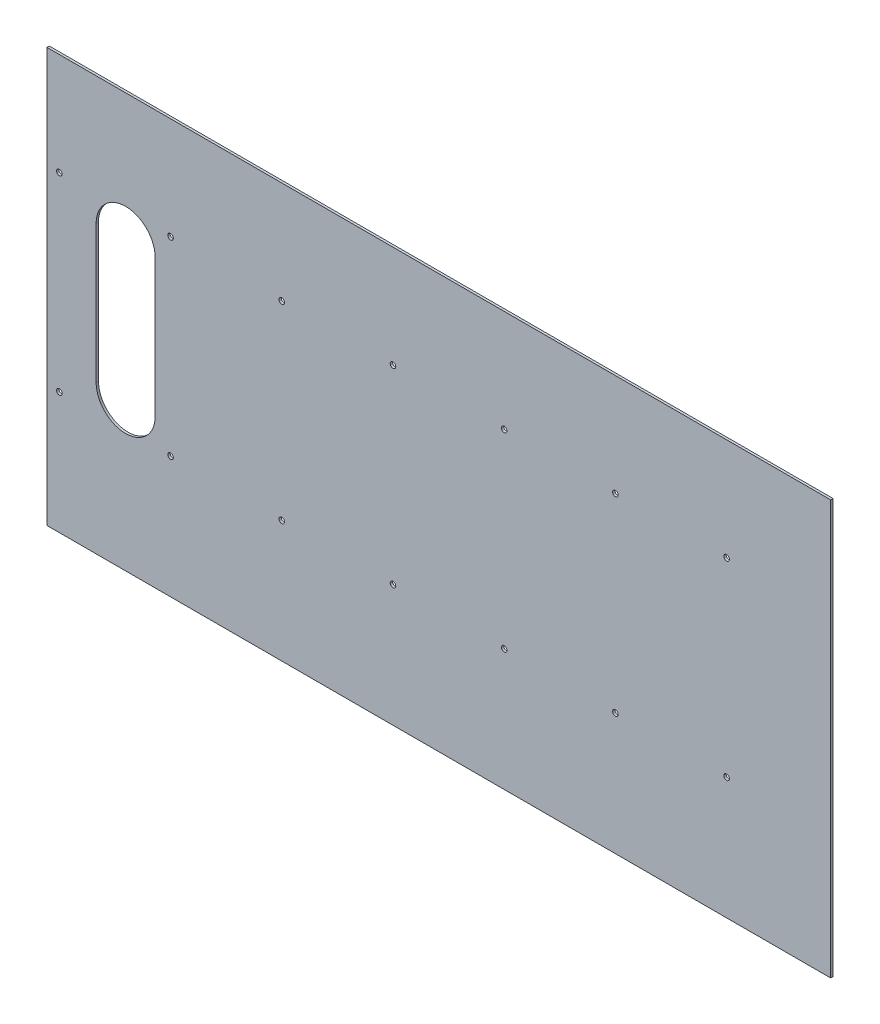
ISO-10303-21;
HEADER;
FILE_DESCRIPTION(('STEP AP214'),'2;1');
FILE_NAME('part.step','',(''),(''),'','','');
FILE_SCHEMA(('AUTOMOTIVE_DESIGN { 1 0 10303 214 1 1 1 1 }'));
ENDSEC;
DATA;
#1=APPLICATION_CONTEXT('core data for automotive mechanical design processes');
#2=APPLICATION_PROTOCOL_DEFINITION('international standard','automotive_design',2000,#1);
#3=PRODUCT_CONTEXT('',#1,'mechanical');
#4=PRODUCT('Part','Part','',(#3));
#5=PRODUCT_RELATED_PRODUCT_CATEGORY('part','',(#4));
#6=PRODUCT_DEFINITION_FORMATION('','',#4);
#7=PRODUCT_DEFINITION_CONTEXT('part definition',#1,'design');
#8=PRODUCT_DEFINITION('design','',#6,#7);
#9=PRODUCT_DEFINITION_SHAPE('','',#8);
#10=(LENGTH_UNIT() NAMED_UNIT(*) SI_UNIT(.MILLI.,.METRE.));
#11=(NAMED_UNIT(*) PLANE_ANGLE_UNIT() SI_UNIT($,.RADIAN.));
#12=(NAMED_UNIT(*) SI_UNIT($,.STERADIAN.) SOLID_ANGLE_UNIT());
#13=UNCERTAINTY_MEASURE_WITH_UNIT(LENGTH_MEASURE(1.E-05),#10,'distance_accuracy_value','');
#14=(GEOMETRIC_REPRESENTATION_CONTEXT(3) GLOBAL_UNCERTAINTY_ASSIGNED_CONTEXT((#13)) GLOBAL_UNIT_ASSIGNED_CONTEXT((#10,
#11,#12)) REPRESENTATION_CONTEXT('',''));
#15=CARTESIAN_POINT('',(0.,0.,0.));
#16=DIRECTION('',(0.,0.,1.));
#17=DIRECTION('',(1.,0.,0.));
#18=AXIS2_PLACEMENT_3D('',#15,#16,#17);
#19=CARTESIAN_POINT('',(-425.1425,-65.01892,1.51892));
#20=DIRECTION('',(1.,0.,0.));
#21=DIRECTION('',(0.,0.,-1.));
#22=AXIS2_PLACEMENT_3D('',#19,#20,#21);
#23=PLANE('',#22);
#24=DIRECTION('',(0.,-1.,0.));
#25=VECTOR('',#24,1.);
#26=CARTESIAN_POINT('',(-425.1425,-65.01892,0.));
#27=LINE('',#26,#25);
#28=CARTESIAN_POINT('',(-425.1425,202.31892,0.));
#29=VERTEX_POINT('',#28);
#30=CARTESIAN_POINT('',(-425.1425,-65.01892,0.));
#31=VERTEX_POINT('',#30);
#32=EDGE_CURVE('E139',#29,#31,#27,.T.);
#33=ORIENTED_EDGE('',*,*,#32,.T.);
#34=DIRECTION('',(0.,0.,-1.));
#35=VECTOR('',#34,1.);
#36=CARTESIAN_POINT('',(-425.1425,-65.01892,1.51892));
#37=LINE('',#36,#35);
#38=CARTESIAN_POINT('',(-425.1425,-65.01892,1.51892));
#39=VERTEX_POINT('',#38);
#40=EDGE_CURVE('E11',#39,#31,#37,.T.);
#41=ORIENTED_EDGE('',*,*,#40,.F.);
#42=DIRECTION('',(0.,-1.,0.));
#43=VECTOR('',#42,1.);
#44=CARTESIAN_POINT('',(-425.1425,-65.01892,1.51892));
#45=LINE('',#44,#43);
#46=CARTESIAN_POINT('',(-425.1425,202.31892,1.51892));
#47=VERTEX_POINT('',#46);
#48=EDGE_CURVE('E143',#47,#39,#45,.T.);
#49=ORIENTED_EDGE('',*,*,#48,.F.);
#50=DIRECTION('',(0.,0.,-1.));
#51=VECTOR('',#50,1.);
#52=CARTESIAN_POINT('',(-425.1425,202.31892,1.51892));
#53=LINE('',#52,#51);
#54=EDGE_CURVE('E153',#47,#29,#53,.T.);
#55=ORIENTED_EDGE('',*,*,#54,.T.);
#56=EDGE_LOOP('',(#33,#41,#49,#55));
#57=FACE_BOUND('',#56,.T.);
#58=ADVANCED_FACE('F38',(#57),#23,.F.);
#59=CARTESIAN_POINT('',(-425.1425,-65.01892,1.51892));
#60=DIRECTION('',(0.,1.,0.));
#61=DIRECTION('',(0.,0.,1.));
#62=AXIS2_PLACEMENT_3D('',#59,#60,#61);
#63=PLANE('',#62);
#64=DIRECTION('',(1.,0.,0.));
#65=VECTOR('',#64,1.);
#66=CARTESIAN_POINT('',(-425.1425,-65.01892,0.));
#67=LINE('',#66,#65);
#68=CARTESIAN_POINT('',(80.8574999999996,-65.01892,0.));
#69=VERTEX_POINT('',#68);
#70=EDGE_CURVE('E156',#31,#69,#67,.T.);
#71=ORIENTED_EDGE('',*,*,#70,.T.);
#72=DIRECTION('',(0.,0.,-1.));
#73=VECTOR('',#72,1.);
#74=CARTESIAN_POINT('',(80.8574999999996,-65.01892,1.51892));
#75=LINE('',#74,#73);
#76=CARTESIAN_POINT('',(80.8574999999996,-65.01892,1.51892));
#77=VERTEX_POINT('',#76);
#78=EDGE_CURVE('E46',#77,#69,#75,.T.);
#79=ORIENTED_EDGE('',*,*,#78,.F.);
#80=DIRECTION('',(1.,0.,0.));
#81=VECTOR('',#80,1.);
#82=CARTESIAN_POINT('',(-425.1425,-65.01892,1.51892));
#83=LINE('',#82,#81);
#84=EDGE_CURVE('E146',#39,#77,#83,.T.);
#85=ORIENTED_EDGE('',*,*,#84,.F.);
#86=ORIENTED_EDGE('',*,*,#40,.T.);
#87=EDGE_LOOP('',(#71,#79,#85,#86));
#88=FACE_BOUND('',#87,.T.);
#89=ADVANCED_FACE('F185',(#88),#63,.F.);
#90=CARTESIAN_POINT('',(80.8574999999996,-65.01892,1.51892));
#91=DIRECTION('',(-1.,0.,0.));
#92=DIRECTION('',(0.,0.,1.));
#93=AXIS2_PLACEMENT_3D('',#90,#91,#92);
#94=PLANE('',#93);
#95=DIRECTION('',(0.,1.,0.));
#96=VECTOR('',#95,1.);
#97=CARTESIAN_POINT('',(80.8574999999996,-65.01892,0.));
#98=LINE('',#97,#96);
#99=CARTESIAN_POINT('',(80.8574999999996,202.31892,0.));
#100=VERTEX_POINT('',#99);
#101=EDGE_CURVE('E158',#69,#100,#98,.T.);
#102=ORIENTED_EDGE('',*,*,#101,.T.);
#103=DIRECTION('',(0.,0.,-1.));
#104=VECTOR('',#103,1.);
#105=CARTESIAN_POINT('',(80.8574999999996,202.31892,1.51892));
#106=LINE('',#105,#104);
#107=CARTESIAN_POINT('',(80.8574999999996,202.31892,1.51892));
#108=VERTEX_POINT('',#107);
#109=EDGE_CURVE('E163',#108,#100,#106,.T.);
#110=ORIENTED_EDGE('',*,*,#109,.F.);
#111=DIRECTION('',(0.,1.,0.));
#112=VECTOR('',#111,1.);
#113=CARTESIAN_POINT('',(80.8574999999996,-65.01892,1.51892));
#114=LINE('',#113,#112);
#115=EDGE_CURVE('E149',#77,#108,#114,.T.);
#116=ORIENTED_EDGE('',*,*,#115,.F.);
#117=ORIENTED_EDGE('',*,*,#78,.T.);
#118=EDGE_LOOP('',(#102,#110,#116,#117));
#119=FACE_BOUND('',#118,.T.);
#120=ADVANCED_FACE('F171',(#119),#94,.F.);
#121=CARTESIAN_POINT('',(-425.1425,202.31892,1.51892));
#122=DIRECTION('',(0.,-1.,0.));
#123=DIRECTION('',(0.,0.,-1.));
#124=AXIS2_PLACEMENT_3D('',#121,#122,#123);
#125=PLANE('',#124);
#126=DIRECTION('',(-1.,0.,0.));
#127=VECTOR('',#126,1.);
#128=CARTESIAN_POINT('',(-425.1425,202.31892,0.));
#129=LINE('',#128,#127);
#130=EDGE_CURVE('E147',#100,#29,#129,.T.);
#131=ORIENTED_EDGE('',*,*,#130,.T.);
#132=ORIENTED_EDGE('',*,*,#54,.F.);
#133=DIRECTION('',(-1.,0.,0.));
#134=VECTOR('',#133,1.);
#135=CARTESIAN_POINT('',(-425.1425,202.31892,1.51892));
#136=LINE('',#135,#134);
#137=EDGE_CURVE('E151',#108,#47,#136,.T.);
#138=ORIENTED_EDGE('',*,*,#137,.F.);
#139=ORIENTED_EDGE('',*,*,#109,.T.);
#140=EDGE_LOOP('',(#131,#132,#138,#139));
#141=FACE_BOUND('',#140,.T.);
#142=ADVANCED_FACE('F178',(#141),#125,.F.);
#143=CARTESIAN_POINT('',(0.,0.,1.51892));
#144=DIRECTION('',(0.,0.,-1.));
#145=DIRECTION('',(-1.,0.,0.));
#146=AXIS2_PLACEMENT_3D('',#143,#144,#145);
#147=PLANE('',#146);
#148=CARTESIAN_POINT('',(-417.1425,136.3375,1.51892));
#149=DIRECTION('',(0.,0.,1.));
#150=DIRECTION('',(1.,0.,0.));
#151=AXIS2_PLACEMENT_3D('',#148,#149,#150);
#152=CIRCLE('',#151,1.79999999999997);
#153=CARTESIAN_POINT('',(-415.3425,136.3375,1.51892));
#154=VERTEX_POINT('',#153);
#155=EDGE_CURVE('E275',#154,#154,#152,.T.);
#156=ORIENTED_EDGE('',*,*,#155,.F.);
#157=EDGE_LOOP('',(#156));
#158=FACE_BOUND('',#157,.T.);
#159=CARTESIAN_POINT('',(-417.1425,13.6624999999999,1.51892));
#160=DIRECTION('',(0.,0.,1.));
#161=DIRECTION('',(1.,0.,0.));
#162=AXIS2_PLACEMENT_3D('',#159,#160,#161);
#163=CIRCLE('',#162,1.79999999999997);
#164=CARTESIAN_POINT('',(-415.3425,13.6624999999999,1.51892));
#165=VERTEX_POINT('',#164);
#166=EDGE_CURVE('E277',#165,#165,#163,.T.);
#167=ORIENTED_EDGE('',*,*,#166,.F.);
#168=EDGE_LOOP('',(#167));
#169=FACE_BOUND('',#168,.T.);
#170=CARTESIAN_POINT('',(-345.341667,136.3375,1.51892));
#171=DIRECTION('',(0.,0.,1.));
#172=DIRECTION('',(1.,0.,0.));
#173=AXIS2_PLACEMENT_3D('',#170,#171,#172);
#174=CIRCLE('',#173,1.79999999999997);
#175=CARTESIAN_POINT('',(-343.541667,136.3375,1.51892));
#176=VERTEX_POINT('',#175);
#177=EDGE_CURVE('E285',#176,#176,#174,.T.);
#178=ORIENTED_EDGE('',*,*,#177,.F.);
#179=EDGE_LOOP('',(#178));
#180=FACE_BOUND('',#179,.T.);
#181=CARTESIAN_POINT('',(-345.341667,13.6624999999999,1.51892));
#182=DIRECTION('',(0.,0.,1.));
#183=DIRECTION('',(1.,0.,0.));
#184=AXIS2_PLACEMENT_3D('',#181,#182,#183);
#185=CIRCLE('',#184,1.79999999999997);
#186=CARTESIAN_POINT('',(-343.541667,13.6624999999999,1.51892));
#187=VERTEX_POINT('',#186);
#188=EDGE_CURVE('E291',#187,#187,#185,.T.);
#189=ORIENTED_EDGE('',*,*,#188,.F.);
#190=EDGE_LOOP('',(#189));
#191=FACE_BOUND('',#190,.T.);
#192=CARTESIAN_POINT('',(-273.540834,136.3375,1.51892));
#193=DIRECTION('',(0.,0.,1.));
#194=DIRECTION('',(1.,0.,0.));
#195=AXIS2_PLACEMENT_3D('',#192,#193,#194);
#196=CIRCLE('',#195,1.79999999999997);
#197=CARTESIAN_POINT('',(-271.740834,136.3375,1.51892));
#198=VERTEX_POINT('',#197);
#199=EDGE_CURVE('E297',#198,#198,#196,.T.);
#200=ORIENTED_EDGE('',*,*,#199,.F.);
#201=EDGE_LOOP('',(#200));
#202=FACE_BOUND('',#201,.T.);
#203=CARTESIAN_POINT('',(-273.540834,13.6624999999999,1.51892));
#204=DIRECTION('',(0.,0.,1.));
#205=DIRECTION('',(1.,0.,0.));
#206=AXIS2_PLACEMENT_3D('',#203,#204,#205);
#207=CIRCLE('',#206,1.79999999999997);
#208=CARTESIAN_POINT('',(-271.740834,13.6624999999999,1.51892));
#209=VERTEX_POINT('',#208);
#210=EDGE_CURVE('E303',#209,#209,#207,.T.);
#211=ORIENTED_EDGE('',*,*,#210,.F.);
#212=EDGE_LOOP('',(#211));
#213=FACE_BOUND('',#212,.T.);
#214=CARTESIAN_POINT('',(-201.740001,136.3375,1.51892));
#215=DIRECTION('',(0.,0.,1.));
#216=DIRECTION('',(1.,0.,0.));
#217=AXIS2_PLACEMENT_3D('',#214,#215,#216);
#218=CIRCLE('',#217,1.8);
#219=CARTESIAN_POINT('',(-199.940001,136.3375,1.51892));
#220=VERTEX_POINT('',#219);
#221=EDGE_CURVE('E309',#220,#220,#218,.T.);
#222=ORIENTED_EDGE('',*,*,#221,.F.);
#223=EDGE_LOOP('',(#222));
#224=FACE_BOUND('',#223,.T.);
#225=CARTESIAN_POINT('',(-201.740001,13.6624999999999,1.51892));
#226=DIRECTION('',(0.,0.,1.));
#227=DIRECTION('',(1.,0.,0.));
#228=AXIS2_PLACEMENT_3D('',#225,#226,#227);
#229=CIRCLE('',#228,1.8);
#230=CARTESIAN_POINT('',(-199.940001,13.6624999999999,1.51892));
#231=VERTEX_POINT('',#230);
#232=EDGE_CURVE('E315',#231,#231,#229,.T.);
#233=ORIENTED_EDGE('',*,*,#232,.F.);
#234=EDGE_LOOP('',(#233));
#235=FACE_BOUND('',#234,.T.);
#236=CARTESIAN_POINT('',(-129.939168,136.3375,1.51892));
#237=DIRECTION('',(0.,0.,1.));
#238=DIRECTION('',(1.,0.,0.));
#239=AXIS2_PLACEMENT_3D('',#236,#237,#238);
#240=CIRCLE('',#239,1.8);
#241=CARTESIAN_POINT('',(-128.139168,136.3375,1.51892));
#242=VERTEX_POINT('',#241);
#243=EDGE_CURVE('E321',#242,#242,#240,.T.);
#244=ORIENTED_EDGE('',*,*,#243,.F.);
#245=EDGE_LOOP('',(#244));
#246=FACE_BOUND('',#245,.T.);
#247=CARTESIAN_POINT('',(-129.939168,13.6624999999999,1.51892));
#248=DIRECTION('',(0.,0.,1.));
#249=DIRECTION('',(1.,0.,0.));
#250=AXIS2_PLACEMENT_3D('',#247,#248,#249);
#251=CIRCLE('',#250,1.8);
#252=CARTESIAN_POINT('',(-128.139168,13.6624999999999,1.51892));
#253=VERTEX_POINT('',#252);
#254=EDGE_CURVE('E327',#253,#253,#251,.T.);
#255=ORIENTED_EDGE('',*,*,#254,.F.);
#256=EDGE_LOOP('',(#255));
#257=FACE_BOUND('',#256,.T.);
#258=CARTESIAN_POINT('',(-58.1383350000004,136.3375,1.51892));
#259=DIRECTION('',(0.,0.,1.));
#260=DIRECTION('',(1.,0.,0.));
#261=AXIS2_PLACEMENT_3D('',#258,#259,#260);
#262=CIRCLE('',#261,1.79999999999999);
#263=CARTESIAN_POINT('',(-56.3383350000004,136.3375,1.51892));
#264=VERTEX_POINT('',#263);
#265=EDGE_CURVE('E333',#264,#264,#262,.T.);
#266=ORIENTED_EDGE('',*,*,#265,.F.);
#267=EDGE_LOOP('',(#266));
#268=FACE_BOUND('',#267,.T.);
#269=CARTESIAN_POINT('',(-58.1383350000004,13.6624999999999,1.51892));
#270=DIRECTION('',(0.,0.,1.));
#271=DIRECTION('',(1.,0.,0.));
#272=AXIS2_PLACEMENT_3D('',#269,#270,#271);
#273=CIRCLE('',#272,1.79999999999999);
#274=CARTESIAN_POINT('',(-56.3383350000004,13.6624999999999,1.51892));
#275=VERTEX_POINT('',#274);
#276=EDGE_CURVE('E339',#275,#275,#273,.T.);
#277=ORIENTED_EDGE('',*,*,#276,.F.);
#278=EDGE_LOOP('',(#277));
#279=FACE_BOUND('',#278,.T.);
#280=CARTESIAN_POINT('',(13.6624979999996,136.3375,1.51892));
#281=DIRECTION('',(0.,0.,1.));
#282=DIRECTION('',(1.,0.,0.));
#283=AXIS2_PLACEMENT_3D('',#280,#281,#282);
#284=CIRCLE('',#283,1.79999999999999);
#285=CARTESIAN_POINT('',(15.4624979999996,136.3375,1.51892));
#286=VERTEX_POINT('',#285);
#287=EDGE_CURVE('E342',#286,#286,#284,.T.);
#288=ORIENTED_EDGE('',*,*,#287,.F.);
#289=EDGE_LOOP('',(#288));
#290=FACE_BOUND('',#289,.T.);
#291=CARTESIAN_POINT('',(13.6624979999996,13.6624999999999,1.51892));
#292=DIRECTION('',(0.,0.,1.));
#293=DIRECTION('',(1.,0.,0.));
#294=AXIS2_PLACEMENT_3D('',#291,#292,#293);
#295=CIRCLE('',#294,1.79999999999999);
#296=CARTESIAN_POINT('',(15.4624979999996,13.6624999999999,1.51892));
#297=VERTEX_POINT('',#296);
#298=EDGE_CURVE('E347',#297,#297,#295,.T.);
#299=ORIENTED_EDGE('',*,*,#298,.F.);
#300=EDGE_LOOP('',(#299));
#301=FACE_BOUND('',#300,.T.);
#302=DIRECTION('',(0.,1.,0.));
#303=VECTOR('',#302,1.);
#304=CARTESIAN_POINT('',(-355.2925,30.86892,1.51892));
#305=LINE('',#304,#303);
#306=CARTESIAN_POINT('',(-355.2925,30.86892,1.51892));
#307=VERTEX_POINT('',#306);
#308=CARTESIAN_POINT('',(-355.2925,119.76892,1.51892));
#309=VERTEX_POINT('',#308);
#310=EDGE_CURVE('E133',#307,#309,#305,.T.);
#311=ORIENTED_EDGE('',*,*,#310,.F.);
#312=CARTESIAN_POINT('',(-374.3425,30.86892,1.51892));
#313=DIRECTION('',(0.,0.,1.));
#314=DIRECTION('',(1.,0.,0.));
#315=AXIS2_PLACEMENT_3D('',#312,#313,#314);
#316=CIRCLE('',#315,19.05);
#317=CARTESIAN_POINT('',(-393.3925,30.86892,1.51892));
#318=VERTEX_POINT('',#317);
#319=EDGE_CURVE('E53',#318,#307,#316,.T.);
#320=ORIENTED_EDGE('',*,*,#319,.F.);
#321=DIRECTION('',(0.,-1.,0.));
#322=VECTOR('',#321,1.);
#323=CARTESIAN_POINT('',(-393.3925,30.86892,1.51892));
#324=LINE('',#323,#322);
#325=CARTESIAN_POINT('',(-393.3925,119.76892,1.51892));
#326=VERTEX_POINT('',#325);
#327=EDGE_CURVE('E121',#326,#318,#324,.T.);
#328=ORIENTED_EDGE('',*,*,#327,.F.);
#329=CARTESIAN_POINT('',(-374.3425,119.76892,1.51892));
#330=DIRECTION('',(0.,0.,1.));
#331=DIRECTION('',(1.,0.,0.));
#332=AXIS2_PLACEMENT_3D('',#329,#330,#331);
#333=CIRCLE('',#332,19.0500000000001);
#334=EDGE_CURVE('E124',#309,#326,#333,.T.);
#335=ORIENTED_EDGE('',*,*,#334,.F.);
#336=EDGE_LOOP('',(#311,#320,#328,#335));
#337=FACE_BOUND('',#336,.T.);
#338=ORIENTED_EDGE('',*,*,#48,.T.);
#339=ORIENTED_EDGE('',*,*,#84,.T.);
#340=ORIENTED_EDGE('',*,*,#115,.T.);
#341=ORIENTED_EDGE('',*,*,#137,.T.);
#342=EDGE_LOOP('',(#338,#339,#340,#341));
#343=FACE_BOUND('',#342,.T.);
#344=ADVANCED_FACE('F184',(#158,#169,#180,#191,#202,#213,#224,#235,#246,#257,#268,#279,#290,
#301,#337,#343),#147,.F.);
#345=CARTESIAN_POINT('',(0.,0.,0.));
#346=DIRECTION('',(0.,0.,-1.));
#347=DIRECTION('',(-1.,0.,0.));
#348=AXIS2_PLACEMENT_3D('',#345,#346,#347);
#349=PLANE('',#348);
#350=CARTESIAN_POINT('',(-417.1425,136.3375,0.));
#351=DIRECTION('',(0.,0.,-1.));
#352=DIRECTION('',(-1.,0.,0.));
#353=AXIS2_PLACEMENT_3D('',#350,#351,#352);
#354=CIRCLE('',#353,1.79999999999997);
#355=CARTESIAN_POINT('',(-418.9425,136.3375,0.));
#356=VERTEX_POINT('',#355);
#357=EDGE_CURVE('E272',#356,#356,#354,.T.);
#358=ORIENTED_EDGE('',*,*,#357,.F.);
#359=EDGE_LOOP('',(#358));
#360=FACE_BOUND('',#359,.T.);
#361=CARTESIAN_POINT('',(-417.1425,13.6624999999999,0.));
#362=DIRECTION('',(0.,0.,-1.));
#363=DIRECTION('',(-1.,0.,0.));
#364=AXIS2_PLACEMENT_3D('',#361,#362,#363);
#365=CIRCLE('',#364,1.79999999999997);
#366=CARTESIAN_POINT('',(-418.9425,13.6624999999999,0.));
#367=VERTEX_POINT('',#366);
#368=EDGE_CURVE('E282',#367,#367,#365,.T.);
#369=ORIENTED_EDGE('',*,*,#368,.F.);
#370=EDGE_LOOP('',(#369));
#371=FACE_BOUND('',#370,.T.);
#372=CARTESIAN_POINT('',(-345.341667,136.3375,0.));
#373=DIRECTION('',(0.,0.,-1.));
#374=DIRECTION('',(-1.,0.,0.));
#375=AXIS2_PLACEMENT_3D('',#372,#373,#374);
#376=CIRCLE('',#375,1.79999999999997);
#377=CARTESIAN_POINT('',(-347.141667,136.3375,0.));
#378=VERTEX_POINT('',#377);
#379=EDGE_CURVE('E288',#378,#378,#376,.T.);
#380=ORIENTED_EDGE('',*,*,#379,.F.);
#381=EDGE_LOOP('',(#380));
#382=FACE_BOUND('',#381,.T.);
#383=CARTESIAN_POINT('',(-345.341667,13.6624999999999,0.));
#384=DIRECTION('',(0.,0.,-1.));
#385=DIRECTION('',(-1.,0.,0.));
#386=AXIS2_PLACEMENT_3D('',#383,#384,#385);
#387=CIRCLE('',#386,1.79999999999997);
#388=CARTESIAN_POINT('',(-347.141667,13.6624999999999,0.));
#389=VERTEX_POINT('',#388);
#390=EDGE_CURVE('E294',#389,#389,#387,.T.);
#391=ORIENTED_EDGE('',*,*,#390,.F.);
#392=EDGE_LOOP('',(#391));
#393=FACE_BOUND('',#392,.T.);
#394=CARTESIAN_POINT('',(-273.540834,136.3375,0.));
#395=DIRECTION('',(0.,0.,-1.));
#396=DIRECTION('',(-1.,0.,0.));
#397=AXIS2_PLACEMENT_3D('',#394,#395,#396);
#398=CIRCLE('',#397,1.79999999999997);
#399=CARTESIAN_POINT('',(-275.340834,136.3375,0.));
#400=VERTEX_POINT('',#399);
#401=EDGE_CURVE('E300',#400,#400,#398,.T.);
#402=ORIENTED_EDGE('',*,*,#401,.F.);
#403=EDGE_LOOP('',(#402));
#404=FACE_BOUND('',#403,.T.);
#405=CARTESIAN_POINT('',(-273.540834,13.6624999999999,0.));
#406=DIRECTION('',(0.,0.,-1.));
#407=DIRECTION('',(-1.,0.,0.));
#408=AXIS2_PLACEMENT_3D('',#405,#406,#407);
#409=CIRCLE('',#408,1.79999999999997);
#410=CARTESIAN_POINT('',(-275.340834,13.6624999999999,0.));
#411=VERTEX_POINT('',#410);
#412=EDGE_CURVE('E306',#411,#411,#409,.T.);
#413=ORIENTED_EDGE('',*,*,#412,.F.);
#414=EDGE_LOOP('',(#413));
#415=FACE_BOUND('',#414,.T.);
#416=CARTESIAN_POINT('',(-201.740001,136.3375,0.));
#417=DIRECTION('',(0.,0.,-1.));
#418=DIRECTION('',(-1.,0.,0.));
#419=AXIS2_PLACEMENT_3D('',#416,#417,#418);
#420=CIRCLE('',#419,1.8);
#421=CARTESIAN_POINT('',(-203.540001,136.3375,0.));
#422=VERTEX_POINT('',#421);
#423=EDGE_CURVE('E312',#422,#422,#420,.T.);
#424=ORIENTED_EDGE('',*,*,#423,.F.);
#425=EDGE_LOOP('',(#424));
#426=FACE_BOUND('',#425,.T.);
#427=CARTESIAN_POINT('',(-201.740001,13.6624999999999,0.));
#428=DIRECTION('',(0.,0.,-1.));
#429=DIRECTION('',(-1.,0.,0.));
#430=AXIS2_PLACEMENT_3D('',#427,#428,#429);
#431=CIRCLE('',#430,1.8);
#432=CARTESIAN_POINT('',(-203.540001,13.6624999999999,0.));
#433=VERTEX_POINT('',#432);
#434=EDGE_CURVE('E318',#433,#433,#431,.T.);
#435=ORIENTED_EDGE('',*,*,#434,.F.);
#436=EDGE_LOOP('',(#435));
#437=FACE_BOUND('',#436,.T.);
#438=CARTESIAN_POINT('',(-129.939168,136.3375,0.));
#439=DIRECTION('',(0.,0.,-1.));
#440=DIRECTION('',(-1.,0.,0.));
#441=AXIS2_PLACEMENT_3D('',#438,#439,#440);
#442=CIRCLE('',#441,1.8);
#443=CARTESIAN_POINT('',(-131.739168,136.3375,0.));
#444=VERTEX_POINT('',#443);
#445=EDGE_CURVE('E324',#444,#444,#442,.T.);
#446=ORIENTED_EDGE('',*,*,#445,.F.);
#447=EDGE_LOOP('',(#446));
#448=FACE_BOUND('',#447,.T.);
#449=CARTESIAN_POINT('',(-129.939168,13.6624999999999,0.));
#450=DIRECTION('',(0.,0.,-1.));
#451=DIRECTION('',(-1.,0.,0.));
#452=AXIS2_PLACEMENT_3D('',#449,#450,#451);
#453=CIRCLE('',#452,1.8);
#454=CARTESIAN_POINT('',(-131.739168,13.6624999999999,0.));
#455=VERTEX_POINT('',#454);
#456=EDGE_CURVE('E330',#455,#455,#453,.T.);
#457=ORIENTED_EDGE('',*,*,#456,.F.);
#458=EDGE_LOOP('',(#457));
#459=FACE_BOUND('',#458,.T.);
#460=CARTESIAN_POINT('',(-58.1383350000004,136.3375,0.));
#461=DIRECTION('',(0.,0.,-1.));
#462=DIRECTION('',(-1.,0.,0.));
#463=AXIS2_PLACEMENT_3D('',#460,#461,#462);
#464=CIRCLE('',#463,1.79999999999999);
#465=CARTESIAN_POINT('',(-59.9383350000004,136.3375,0.));
#466=VERTEX_POINT('',#465);
#467=EDGE_CURVE('E336',#466,#466,#464,.T.);
#468=ORIENTED_EDGE('',*,*,#467,.F.);
#469=EDGE_LOOP('',(#468));
#470=FACE_BOUND('',#469,.T.);
#471=CARTESIAN_POINT('',(-58.1383350000004,13.6624999999999,0.));
#472=DIRECTION('',(0.,0.,-1.));
#473=DIRECTION('',(-1.,0.,0.));
#474=AXIS2_PLACEMENT_3D('',#471,#472,#473);
#475=CIRCLE('',#474,1.79999999999999);
#476=CARTESIAN_POINT('',(-59.9383350000004,13.6624999999999,0.));
#477=VERTEX_POINT('',#476);
#478=EDGE_CURVE('E41',#477,#477,#475,.T.);
#479=ORIENTED_EDGE('',*,*,#478,.F.);
#480=EDGE_LOOP('',(#479));
#481=FACE_BOUND('',#480,.T.);
#482=CARTESIAN_POINT('',(13.6624979999996,136.3375,0.));
#483=DIRECTION('',(0.,0.,-1.));
#484=DIRECTION('',(-1.,0.,0.));
#485=AXIS2_PLACEMENT_3D('',#482,#483,#484);
#486=CIRCLE('',#485,1.79999999999999);
#487=CARTESIAN_POINT('',(11.8624979999996,136.3375,0.));
#488=VERTEX_POINT('',#487);
#489=EDGE_CURVE('E345',#488,#488,#486,.T.);
#490=ORIENTED_EDGE('',*,*,#489,.F.);
#491=EDGE_LOOP('',(#490));
#492=FACE_BOUND('',#491,.T.);
#493=CARTESIAN_POINT('',(13.6624979999996,13.6624999999999,0.));
#494=DIRECTION('',(0.,0.,-1.));
#495=DIRECTION('',(-1.,0.,0.));
#496=AXIS2_PLACEMENT_3D('',#493,#494,#495);
#497=CIRCLE('',#496,1.79999999999999);
#498=CARTESIAN_POINT('',(11.8624979999996,13.6624999999999,0.));
#499=VERTEX_POINT('',#498);
#500=EDGE_CURVE('E127',#499,#499,#497,.T.);
#501=ORIENTED_EDGE('',*,*,#500,.F.);
#502=EDGE_LOOP('',(#501));
#503=FACE_BOUND('',#502,.T.);
#504=CARTESIAN_POINT('',(-374.3425,30.86892,0.));
#505=DIRECTION('',(0.,0.,1.));
#506=DIRECTION('',(1.,0.,0.));
#507=AXIS2_PLACEMENT_3D('',#504,#505,#506);
#508=CIRCLE('',#507,19.05);
#509=CARTESIAN_POINT('',(-393.3925,30.86892,0.));
#510=VERTEX_POINT('',#509);
#511=CARTESIAN_POINT('',(-355.2925,30.86892,0.));
#512=VERTEX_POINT('',#511);
#513=EDGE_CURVE('E105',#510,#512,#508,.T.);
#514=ORIENTED_EDGE('',*,*,#513,.T.);
#515=DIRECTION('',(0.,1.,0.));
#516=VECTOR('',#515,1.);
#517=CARTESIAN_POINT('',(-355.2925,30.86892,0.));
#518=LINE('',#517,#516);
#519=CARTESIAN_POINT('',(-355.2925,119.76892,0.));
#520=VERTEX_POINT('',#519);
#521=EDGE_CURVE('E114',#512,#520,#518,.T.);
#522=ORIENTED_EDGE('',*,*,#521,.T.);
#523=CARTESIAN_POINT('',(-374.3425,119.76892,0.));
#524=DIRECTION('',(0.,0.,1.));
#525=DIRECTION('',(1.,0.,0.));
#526=AXIS2_PLACEMENT_3D('',#523,#524,#525);
#527=CIRCLE('',#526,19.0500000000001);
#528=CARTESIAN_POINT('',(-393.3925,119.76892,0.));
#529=VERTEX_POINT('',#528);
#530=EDGE_CURVE('E61',#520,#529,#527,.T.);
#531=ORIENTED_EDGE('',*,*,#530,.T.);
#532=DIRECTION('',(0.,-1.,0.));
#533=VECTOR('',#532,1.);
#534=CARTESIAN_POINT('',(-393.3925,30.86892,0.));
#535=LINE('',#534,#533);
#536=EDGE_CURVE('E111',#529,#510,#535,.T.);
#537=ORIENTED_EDGE('',*,*,#536,.T.);
#538=EDGE_LOOP('',(#514,#522,#531,#537));
#539=FACE_BOUND('',#538,.T.);
#540=ORIENTED_EDGE('',*,*,#32,.F.);
#541=ORIENTED_EDGE('',*,*,#130,.F.);
#542=ORIENTED_EDGE('',*,*,#101,.F.);
#543=ORIENTED_EDGE('',*,*,#70,.F.);
#544=EDGE_LOOP('',(#540,#541,#542,#543));
#545=FACE_BOUND('',#544,.T.);
#546=ADVANCED_FACE('F118',(#360,#371,#382,#393,#404,#415,#426,#437,#448,#459,#470,#481,#492,
#503,#539,#545),#349,.T.);
#547=CARTESIAN_POINT('',(-374.3425,30.86892,0.));
#548=DIRECTION('',(0.,0.,1.));
#549=DIRECTION('',(1.,0.,0.));
#550=AXIS2_PLACEMENT_3D('',#547,#548,#549);
#551=CYLINDRICAL_SURFACE('',#550,19.05);
#552=ORIENTED_EDGE('',*,*,#319,.T.);
#553=DIRECTION('',(0.,0.,1.));
#554=VECTOR('',#553,1.);
#555=CARTESIAN_POINT('',(-355.2925,30.86892,0.));
#556=LINE('',#555,#554);
#557=EDGE_CURVE('E101',#512,#307,#556,.T.);
#558=ORIENTED_EDGE('',*,*,#557,.F.);
#559=ORIENTED_EDGE('',*,*,#513,.F.);
#560=DIRECTION('',(0.,0.,1.));
#561=VECTOR('',#560,1.);
#562=CARTESIAN_POINT('',(-393.3925,30.86892,0.));
#563=LINE('',#562,#561);
#564=EDGE_CURVE('E137',#510,#318,#563,.T.);
#565=ORIENTED_EDGE('',*,*,#564,.T.);
#566=EDGE_LOOP('',(#552,#558,#559,#565));
#567=FACE_BOUND('',#566,.T.);
#568=ADVANCED_FACE('F103',(#567),#551,.F.);
#569=CARTESIAN_POINT('',(-393.3925,30.86892,0.));
#570=DIRECTION('',(-1.,0.,0.));
#571=DIRECTION('',(0.,-1.,0.));
#572=AXIS2_PLACEMENT_3D('',#569,#570,#571);
#573=PLANE('',#572);
#574=ORIENTED_EDGE('',*,*,#327,.T.);
#575=ORIENTED_EDGE('',*,*,#564,.F.);
#576=ORIENTED_EDGE('',*,*,#536,.F.);
#577=DIRECTION('',(0.,0.,1.));
#578=VECTOR('',#577,1.);
#579=CARTESIAN_POINT('',(-393.3925,119.76892,0.));
#580=LINE('',#579,#578);
#581=EDGE_CURVE('E140',#529,#326,#580,.T.);
#582=ORIENTED_EDGE('',*,*,#581,.T.);
#583=EDGE_LOOP('',(#574,#575,#576,#582));
#584=FACE_BOUND('',#583,.T.);
#585=ADVANCED_FACE('F203',(#584),#573,.F.);
#586=CARTESIAN_POINT('',(-374.3425,119.76892,0.));
#587=DIRECTION('',(0.,0.,1.));
#588=DIRECTION('',(1.,0.,0.));
#589=AXIS2_PLACEMENT_3D('',#586,#587,#588);
#590=CYLINDRICAL_SURFACE('',#589,19.0500000000001);
#591=ORIENTED_EDGE('',*,*,#334,.T.);
#592=ORIENTED_EDGE('',*,*,#581,.F.);
#593=ORIENTED_EDGE('',*,*,#530,.F.);
#594=DIRECTION('',(0.,0.,1.));
#595=VECTOR('',#594,1.);
#596=CARTESIAN_POINT('',(-355.2925,119.76892,0.));
#597=LINE('',#596,#595);
#598=EDGE_CURVE('E110',#520,#309,#597,.T.);
#599=ORIENTED_EDGE('',*,*,#598,.T.);
#600=EDGE_LOOP('',(#591,#592,#593,#599));
#601=FACE_BOUND('',#600,.T.);
#602=ADVANCED_FACE('F207',(#601),#590,.F.);
#603=CARTESIAN_POINT('',(-355.2925,30.86892,0.));
#604=DIRECTION('',(1.,0.,0.));
#605=DIRECTION('',(0.,1.,0.));
#606=AXIS2_PLACEMENT_3D('',#603,#604,#605);
#607=PLANE('',#606);
#608=ORIENTED_EDGE('',*,*,#310,.T.);
#609=ORIENTED_EDGE('',*,*,#598,.F.);
#610=ORIENTED_EDGE('',*,*,#521,.F.);
#611=ORIENTED_EDGE('',*,*,#557,.T.);
#612=EDGE_LOOP('',(#608,#609,#610,#611));
#613=FACE_BOUND('',#612,.T.);
#614=ADVANCED_FACE('F115',(#613),#607,.F.);
#615=CARTESIAN_POINT('',(13.6624979999996,13.6624999999999,1.51892));
#616=DIRECTION('',(0.,0.,1.));
#617=DIRECTION('',(1.,0.,0.));
#618=AXIS2_PLACEMENT_3D('',#615,#616,#617);
#619=CYLINDRICAL_SURFACE('',#618,1.79999999999999);
#620=ORIENTED_EDGE('',*,*,#500,.T.);
#621=EDGE_LOOP('',(#620));
#622=FACE_BOUND('',#621,.T.);
#623=ORIENTED_EDGE('',*,*,#298,.T.);
#624=EDGE_LOOP('',(#623));
#625=FACE_BOUND('',#624,.T.);
#626=ADVANCED_FACE('F206',(#622,#625),#619,.F.);
#627=CARTESIAN_POINT('',(13.6624979999996,136.3375,1.51892));
#628=DIRECTION('',(0.,0.,1.));
#629=DIRECTION('',(1.,0.,0.));
#630=AXIS2_PLACEMENT_3D('',#627,#628,#629);
#631=CYLINDRICAL_SURFACE('',#630,1.79999999999999);
#632=ORIENTED_EDGE('',*,*,#489,.T.);
#633=EDGE_LOOP('',(#632));
#634=FACE_BOUND('',#633,.T.);
#635=ORIENTED_EDGE('',*,*,#287,.T.);
#636=EDGE_LOOP('',(#635));
#637=FACE_BOUND('',#636,.T.);
#638=ADVANCED_FACE('F215',(#634,#637),#631,.F.);
#639=CARTESIAN_POINT('',(-58.1383350000004,13.6624999999999,1.51892));
#640=DIRECTION('',(0.,0.,1.));
#641=DIRECTION('',(1.,0.,0.));
#642=AXIS2_PLACEMENT_3D('',#639,#640,#641);
#643=CYLINDRICAL_SURFACE('',#642,1.79999999999999);
#644=ORIENTED_EDGE('',*,*,#478,.T.);
#645=EDGE_LOOP('',(#644));
#646=FACE_BOUND('',#645,.T.);
#647=ORIENTED_EDGE('',*,*,#276,.T.);
#648=EDGE_LOOP('',(#647));
#649=FACE_BOUND('',#648,.T.);
#650=ADVANCED_FACE('F219',(#646,#649),#643,.F.);
#651=CARTESIAN_POINT('',(-58.1383350000004,136.3375,1.51892));
#652=DIRECTION('',(0.,0.,1.));
#653=DIRECTION('',(1.,0.,0.));
#654=AXIS2_PLACEMENT_3D('',#651,#652,#653);
#655=CYLINDRICAL_SURFACE('',#654,1.79999999999999);
#656=ORIENTED_EDGE('',*,*,#467,.T.);
#657=EDGE_LOOP('',(#656));
#658=FACE_BOUND('',#657,.T.);
#659=ORIENTED_EDGE('',*,*,#265,.T.);
#660=EDGE_LOOP('',(#659));
#661=FACE_BOUND('',#660,.T.);
#662=ADVANCED_FACE('F223',(#658,#661),#655,.F.);
#663=CARTESIAN_POINT('',(-129.939168,13.6624999999999,1.51892));
#664=DIRECTION('',(0.,0.,1.));
#665=DIRECTION('',(1.,0.,0.));
#666=AXIS2_PLACEMENT_3D('',#663,#664,#665);
#667=CYLINDRICAL_SURFACE('',#666,1.8);
#668=ORIENTED_EDGE('',*,*,#456,.T.);
#669=EDGE_LOOP('',(#668));
#670=FACE_BOUND('',#669,.T.);
#671=ORIENTED_EDGE('',*,*,#254,.T.);
#672=EDGE_LOOP('',(#671));
#673=FACE_BOUND('',#672,.T.);
#674=ADVANCED_FACE('F227',(#670,#673),#667,.F.);
#675=CARTESIAN_POINT('',(-129.939168,136.3375,1.51892));
#676=DIRECTION('',(0.,0.,1.));
#677=DIRECTION('',(1.,0.,0.));
#678=AXIS2_PLACEMENT_3D('',#675,#676,#677);
#679=CYLINDRICAL_SURFACE('',#678,1.8);
#680=ORIENTED_EDGE('',*,*,#445,.T.);
#681=EDGE_LOOP('',(#680));
#682=FACE_BOUND('',#681,.T.);
#683=ORIENTED_EDGE('',*,*,#243,.T.);
#684=EDGE_LOOP('',(#683));
#685=FACE_BOUND('',#684,.T.);
#686=ADVANCED_FACE('F231',(#682,#685),#679,.F.);
#687=CARTESIAN_POINT('',(-201.740001,13.6624999999999,1.51892));
#688=DIRECTION('',(0.,0.,1.));
#689=DIRECTION('',(1.,0.,0.));
#690=AXIS2_PLACEMENT_3D('',#687,#688,#689);
#691=CYLINDRICAL_SURFACE('',#690,1.8);
#692=ORIENTED_EDGE('',*,*,#434,.T.);
#693=EDGE_LOOP('',(#692));
#694=FACE_BOUND('',#693,.T.);
#695=ORIENTED_EDGE('',*,*,#232,.T.);
#696=EDGE_LOOP('',(#695));
#697=FACE_BOUND('',#696,.T.);
#698=ADVANCED_FACE('F235',(#694,#697),#691,.F.);
#699=CARTESIAN_POINT('',(-201.740001,136.3375,1.51892));
#700=DIRECTION('',(0.,0.,1.));
#701=DIRECTION('',(1.,0.,0.));
#702=AXIS2_PLACEMENT_3D('',#699,#700,#701);
#703=CYLINDRICAL_SURFACE('',#702,1.8);
#704=ORIENTED_EDGE('',*,*,#423,.T.);
#705=EDGE_LOOP('',(#704));
#706=FACE_BOUND('',#705,.T.);
#707=ORIENTED_EDGE('',*,*,#221,.T.);
#708=EDGE_LOOP('',(#707));
#709=FACE_BOUND('',#708,.T.);
#710=ADVANCED_FACE('F239',(#706,#709),#703,.F.);
#711=CARTESIAN_POINT('',(-273.540834,13.6624999999999,1.51892));
#712=DIRECTION('',(0.,0.,1.));
#713=DIRECTION('',(1.,0.,0.));
#714=AXIS2_PLACEMENT_3D('',#711,#712,#713);
#715=CYLINDRICAL_SURFACE('',#714,1.79999999999997);
#716=ORIENTED_EDGE('',*,*,#412,.T.);
#717=EDGE_LOOP('',(#716));
#718=FACE_BOUND('',#717,.T.);
#719=ORIENTED_EDGE('',*,*,#210,.T.);
#720=EDGE_LOOP('',(#719));
#721=FACE_BOUND('',#720,.T.);
#722=ADVANCED_FACE('F243',(#718,#721),#715,.F.);
#723=CARTESIAN_POINT('',(-273.540834,136.3375,1.51892));
#724=DIRECTION('',(0.,0.,1.));
#725=DIRECTION('',(1.,0.,0.));
#726=AXIS2_PLACEMENT_3D('',#723,#724,#725);
#727=CYLINDRICAL_SURFACE('',#726,1.79999999999997);
#728=ORIENTED_EDGE('',*,*,#401,.T.);
#729=EDGE_LOOP('',(#728));
#730=FACE_BOUND('',#729,.T.);
#731=ORIENTED_EDGE('',*,*,#199,.T.);
#732=EDGE_LOOP('',(#731));
#733=FACE_BOUND('',#732,.T.);
#734=ADVANCED_FACE('F247',(#730,#733),#727,.F.);
#735=CARTESIAN_POINT('',(-345.341667,13.6624999999999,1.51892));
#736=DIRECTION('',(0.,0.,1.));
#737=DIRECTION('',(1.,0.,0.));
#738=AXIS2_PLACEMENT_3D('',#735,#736,#737);
#739=CYLINDRICAL_SURFACE('',#738,1.79999999999997);
#740=ORIENTED_EDGE('',*,*,#390,.T.);
#741=EDGE_LOOP('',(#740));
#742=FACE_BOUND('',#741,.T.);
#743=ORIENTED_EDGE('',*,*,#188,.T.);
#744=EDGE_LOOP('',(#743));
#745=FACE_BOUND('',#744,.T.);
#746=ADVANCED_FACE('F251',(#742,#745),#739,.F.);
#747=CARTESIAN_POINT('',(-345.341667,136.3375,1.51892));
#748=DIRECTION('',(0.,0.,1.));
#749=DIRECTION('',(1.,0.,0.));
#750=AXIS2_PLACEMENT_3D('',#747,#748,#749);
#751=CYLINDRICAL_SURFACE('',#750,1.79999999999997);
#752=ORIENTED_EDGE('',*,*,#379,.T.);
#753=EDGE_LOOP('',(#752));
#754=FACE_BOUND('',#753,.T.);
#755=ORIENTED_EDGE('',*,*,#177,.T.);
#756=EDGE_LOOP('',(#755));
#757=FACE_BOUND('',#756,.T.);
#758=ADVANCED_FACE('F255',(#754,#757),#751,.F.);
#759=CARTESIAN_POINT('',(-417.1425,13.6624999999999,1.51892));
#760=DIRECTION('',(0.,0.,1.));
#761=DIRECTION('',(1.,0.,0.));
#762=AXIS2_PLACEMENT_3D('',#759,#760,#761);
#763=CYLINDRICAL_SURFACE('',#762,1.79999999999997);
#764=ORIENTED_EDGE('',*,*,#368,.T.);
#765=EDGE_LOOP('',(#764));
#766=FACE_BOUND('',#765,.T.);
#767=ORIENTED_EDGE('',*,*,#166,.T.);
#768=EDGE_LOOP('',(#767));
#769=FACE_BOUND('',#768,.T.);
#770=ADVANCED_FACE('F259',(#766,#769),#763,.F.);
#771=CARTESIAN_POINT('',(-417.1425,136.3375,1.51892));
#772=DIRECTION('',(0.,0.,1.));
#773=DIRECTION('',(1.,0.,0.));
#774=AXIS2_PLACEMENT_3D('',#771,#772,#773);
#775=CYLINDRICAL_SURFACE('',#774,1.79999999999997);
#776=ORIENTED_EDGE('',*,*,#357,.T.);
#777=EDGE_LOOP('',(#776));
#778=FACE_BOUND('',#777,.T.);
#779=ORIENTED_EDGE('',*,*,#155,.T.);
#780=EDGE_LOOP('',(#779));
#781=FACE_BOUND('',#780,.T.);
#782=ADVANCED_FACE('F263',(#778,#781),#775,.F.);
#783=CLOSED_SHELL('',(#58,#89,#120,#142,#344,#546,#568,#585,#602,#614,#626,#638,#650,#662,#674,
#686,#698,#710,#722,#734,#746,#758,#770,#782));
#784=MANIFOLD_SOLID_BREP('B2',#783);
#785=ADVANCED_BREP_SHAPE_REPRESENTATION('',(#18,#784),#14);
#786=SHAPE_DEFINITION_REPRESENTATION(#9,#785);
ENDSEC;
END-ISO-10303-21;
